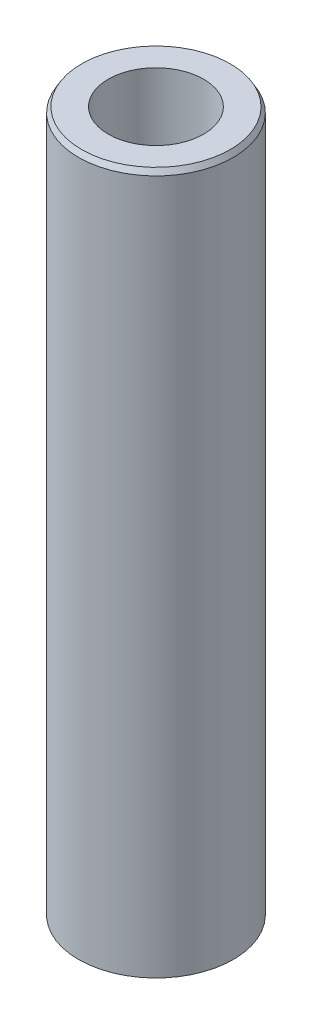
ISO-10303-21;
HEADER;
FILE_DESCRIPTION(('STEP AP214'),'2;1');
FILE_NAME('part.step','',(''),(''),'','','');
FILE_SCHEMA(('AUTOMOTIVE_DESIGN { 1 0 10303 214 1 1 1 1 }'));
ENDSEC;
DATA;
#1=APPLICATION_CONTEXT('core data for automotive mechanical design processes');
#2=APPLICATION_PROTOCOL_DEFINITION('international standard','automotive_design',2000,#1);
#3=PRODUCT_CONTEXT('',#1,'mechanical');
#4=PRODUCT('Part','Part','',(#3));
#5=PRODUCT_RELATED_PRODUCT_CATEGORY('part','',(#4));
#6=PRODUCT_DEFINITION_FORMATION('','',#4);
#7=PRODUCT_DEFINITION_CONTEXT('part definition',#1,'design');
#8=PRODUCT_DEFINITION('design','',#6,#7);
#9=PRODUCT_DEFINITION_SHAPE('','',#8);
#10=(LENGTH_UNIT() NAMED_UNIT(*) SI_UNIT(.MILLI.,.METRE.));
#11=(NAMED_UNIT(*) PLANE_ANGLE_UNIT() SI_UNIT($,.RADIAN.));
#12=(NAMED_UNIT(*) SI_UNIT($,.STERADIAN.) SOLID_ANGLE_UNIT());
#13=UNCERTAINTY_MEASURE_WITH_UNIT(LENGTH_MEASURE(1.E-05),#10,'distance_accuracy_value','');
#14=(GEOMETRIC_REPRESENTATION_CONTEXT(3) GLOBAL_UNCERTAINTY_ASSIGNED_CONTEXT((#13)) GLOBAL_UNIT_ASSIGNED_CONTEXT((#10,
#11,#12)) REPRESENTATION_CONTEXT('',''));
#15=CARTESIAN_POINT('',(0.,0.,0.));
#16=DIRECTION('',(0.,0.,1.));
#17=DIRECTION('',(1.,0.,0.));
#18=AXIS2_PLACEMENT_3D('',#15,#16,#17);
#19=CARTESIAN_POINT('',(0.,90.8574408595503,0.));
#20=DIRECTION('',(0.,-1.,0.));
#21=DIRECTION('',(0.,0.,-1.));
#22=AXIS2_PLACEMENT_3D('',#19,#20,#21);
#23=CYLINDRICAL_SURFACE('',#22,10.);
#24=CARTESIAN_POINT('',(0.,90.1735244256097,0.));
#25=DIRECTION('',(0.,1.,0.));
#26=DIRECTION('',(0.,0.,1.));
#27=AXIS2_PLACEMENT_3D('',#24,#25,#26);
#28=CIRCLE('',#27,10.);
#29=CARTESIAN_POINT('',(0.,90.1735244256097,10.));
#30=VERTEX_POINT('',#29);
#31=EDGE_CURVE('E50',#30,#30,#28,.F.);
#32=ORIENTED_EDGE('',*,*,#31,.T.);
#33=EDGE_LOOP('',(#32));
#34=FACE_BOUND('',#33,.T.);
#35=CARTESIAN_POINT('',(0.,0.394859337238831,0.));
#36=DIRECTION('',(0.,1.,0.));
#37=DIRECTION('',(0.,0.,1.));
#38=AXIS2_PLACEMENT_3D('',#35,#36,#37);
#39=CIRCLE('',#38,10.);
#40=CARTESIAN_POINT('',(0.,0.394859337238831,10.));
#41=VERTEX_POINT('',#40);
#42=EDGE_CURVE('E51',#41,#41,#39,.T.);
#43=ORIENTED_EDGE('',*,*,#42,.T.);
#44=EDGE_LOOP('',(#43));
#45=FACE_BOUND('',#44,.T.);
#46=ADVANCED_FACE('F39',(#34,#45),#23,.T.);
#47=CARTESIAN_POINT('',(0.,90.8574408595503,0.));
#48=DIRECTION('',(0.,1.,0.));
#49=DIRECTION('',(0.,0.,1.));
#50=AXIS2_PLACEMENT_3D('',#47,#48,#49);
#51=PLANE('',#50);
#52=CARTESIAN_POINT('',(0.,90.8574408595503,0.));
#53=DIRECTION('',(0.,1.,0.));
#54=DIRECTION('',(0.,0.,1.));
#55=AXIS2_PLACEMENT_3D('',#52,#53,#54);
#56=CIRCLE('',#55,9.60514066276119);
#57=CARTESIAN_POINT('',(0.,90.8574408595503,9.60514066276119));
#58=VERTEX_POINT('',#57);
#59=EDGE_CURVE('E54',#58,#58,#56,.T.);
#60=ORIENTED_EDGE('',*,*,#59,.T.);
#61=EDGE_LOOP('',(#60));
#62=FACE_BOUND('',#61,.T.);
#63=CARTESIAN_POINT('',(0.,90.8574408595503,0.));
#64=DIRECTION('',(0.,1.,0.));
#65=DIRECTION('',(0.,0.,1.));
#66=AXIS2_PLACEMENT_3D('',#63,#64,#65);
#67=CIRCLE('',#66,6.16335095313841);
#68=CARTESIAN_POINT('',(0.,90.8574408595503,6.16335095313841));
#69=VERTEX_POINT('',#68);
#70=EDGE_CURVE('E58',#69,#69,#67,.T.);
#71=ORIENTED_EDGE('',*,*,#70,.F.);
#72=EDGE_LOOP('',(#71));
#73=FACE_BOUND('',#72,.T.);
#74=ADVANCED_FACE('F69',(#62,#73),#51,.T.);
#75=CARTESIAN_POINT('',(0.,0.,0.));
#76=DIRECTION('',(0.,1.,0.));
#77=DIRECTION('',(0.,0.,1.));
#78=AXIS2_PLACEMENT_3D('',#75,#76,#77);
#79=PLANE('',#78);
#80=CARTESIAN_POINT('',(0.,0.,0.));
#81=DIRECTION('',(0.,1.,0.));
#82=DIRECTION('',(0.,0.,1.));
#83=AXIS2_PLACEMENT_3D('',#80,#81,#82);
#84=CIRCLE('',#83,9.31608356605937);
#85=CARTESIAN_POINT('',(0.,0.,9.31608356605937));
#86=VERTEX_POINT('',#85);
#87=EDGE_CURVE('E10',#86,#86,#84,.F.);
#88=ORIENTED_EDGE('',*,*,#87,.T.);
#89=EDGE_LOOP('',(#88));
#90=FACE_BOUND('',#89,.T.);
#91=CARTESIAN_POINT('',(0.,0.,0.));
#92=DIRECTION('',(0.,1.,0.));
#93=DIRECTION('',(0.,0.,1.));
#94=AXIS2_PLACEMENT_3D('',#91,#92,#93);
#95=CIRCLE('',#94,6.16335095313841);
#96=CARTESIAN_POINT('',(0.,0.,6.16335095313841));
#97=VERTEX_POINT('',#96);
#98=EDGE_CURVE('E63',#97,#97,#95,.T.);
#99=ORIENTED_EDGE('',*,*,#98,.T.);
#100=EDGE_LOOP('',(#99));
#101=FACE_BOUND('',#100,.T.);
#102=ADVANCED_FACE('F75',(#90,#101),#79,.F.);
#103=CARTESIAN_POINT('',(0.,90.8574408595503,0.));
#104=DIRECTION('',(0.,-1.,0.));
#105=DIRECTION('',(0.,0.,-1.));
#106=AXIS2_PLACEMENT_3D('',#103,#104,#105);
#107=CYLINDRICAL_SURFACE('',#106,6.16335095313841);
#108=ORIENTED_EDGE('',*,*,#70,.T.);
#109=EDGE_LOOP('',(#108));
#110=FACE_BOUND('',#109,.T.);
#111=ORIENTED_EDGE('',*,*,#98,.F.);
#112=EDGE_LOOP('',(#111));
#113=FACE_BOUND('',#112,.T.);
#114=ADVANCED_FACE('F70',(#110,#113),#107,.F.);
#115=CARTESIAN_POINT('',(0.,90.8574408595503,0.));
#116=DIRECTION('',(0.,-1.,0.));
#117=DIRECTION('',(0.,0.,-1.));
#118=AXIS2_PLACEMENT_3D('',#115,#116,#117);
#119=CONICAL_SURFACE('',#118,9.60514066276119,0.523598775598293);
#120=ORIENTED_EDGE('',*,*,#31,.F.);
#121=EDGE_LOOP('',(#120));
#122=FACE_BOUND('',#121,.T.);
#123=ORIENTED_EDGE('',*,*,#59,.F.);
#124=EDGE_LOOP('',(#123));
#125=FACE_BOUND('',#124,.T.);
#126=ADVANCED_FACE('F81',(#122,#125),#119,.T.);
#127=CARTESIAN_POINT('',(0.,0.394859337238831,0.));
#128=DIRECTION('',(0.,1.,0.));
#129=DIRECTION('',(0.,0.,1.));
#130=AXIS2_PLACEMENT_3D('',#127,#128,#129);
#131=CONICAL_SURFACE('',#130,10.,1.0471975511966);
#132=ORIENTED_EDGE('',*,*,#87,.F.);
#133=EDGE_LOOP('',(#132));
#134=FACE_BOUND('',#133,.T.);
#135=ORIENTED_EDGE('',*,*,#42,.F.);
#136=EDGE_LOOP('',(#135));
#137=FACE_BOUND('',#136,.T.);
#138=ADVANCED_FACE('F45',(#134,#137),#131,.T.);
#139=CLOSED_SHELL('',(#46,#74,#102,#114,#126,#138));
#140=MANIFOLD_SOLID_BREP('B2',#139);
#141=ADVANCED_BREP_SHAPE_REPRESENTATION('',(#18,#140),#14);
#142=SHAPE_DEFINITION_REPRESENTATION(#9,#141);
ENDSEC;
END-ISO-10303-21;
